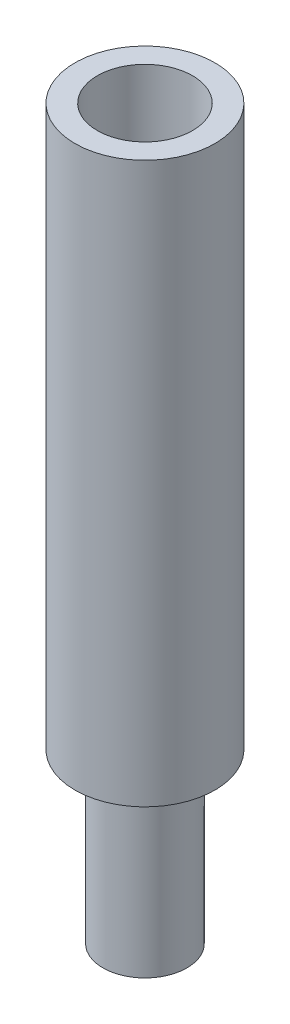
ISO-10303-21;
HEADER;
FILE_DESCRIPTION(('STEP AP214'),'2;1');
FILE_NAME('part.step','',(''),(''),'','','');
FILE_SCHEMA(('AUTOMOTIVE_DESIGN { 1 0 10303 214 1 1 1 1 }'));
ENDSEC;
DATA;
#1=APPLICATION_CONTEXT('core data for automotive mechanical design processes');
#2=APPLICATION_PROTOCOL_DEFINITION('international standard','automotive_design',2000,#1);
#3=PRODUCT_CONTEXT('',#1,'mechanical');
#4=PRODUCT('Part','Part','',(#3));
#5=PRODUCT_RELATED_PRODUCT_CATEGORY('part','',(#4));
#6=PRODUCT_DEFINITION_FORMATION('','',#4);
#7=PRODUCT_DEFINITION_CONTEXT('part definition',#1,'design');
#8=PRODUCT_DEFINITION('design','',#6,#7);
#9=PRODUCT_DEFINITION_SHAPE('','',#8);
#10=(LENGTH_UNIT() NAMED_UNIT(*) SI_UNIT(.MILLI.,.METRE.));
#11=(NAMED_UNIT(*) PLANE_ANGLE_UNIT() SI_UNIT($,.RADIAN.));
#12=(NAMED_UNIT(*) SI_UNIT($,.STERADIAN.) SOLID_ANGLE_UNIT());
#13=UNCERTAINTY_MEASURE_WITH_UNIT(LENGTH_MEASURE(1.E-05),#10,'distance_accuracy_value','');
#14=(GEOMETRIC_REPRESENTATION_CONTEXT(3) GLOBAL_UNCERTAINTY_ASSIGNED_CONTEXT((#13)) GLOBAL_UNIT_ASSIGNED_CONTEXT((#10,
#11,#12)) REPRESENTATION_CONTEXT('',''));
#15=CARTESIAN_POINT('',(0.,0.,0.));
#16=DIRECTION('',(0.,0.,1.));
#17=DIRECTION('',(1.,0.,0.));
#18=AXIS2_PLACEMENT_3D('',#15,#16,#17);
#19=CARTESIAN_POINT('',(0.,20.,0.));
#20=DIRECTION('',(0.,-1.,0.));
#21=DIRECTION('',(0.,0.,-1.));
#22=AXIS2_PLACEMENT_3D('',#19,#20,#21);
#23=CYLINDRICAL_SURFACE('',#22,2.5);
#24=CARTESIAN_POINT('',(0.,20.,0.));
#25=DIRECTION('',(0.,1.,0.));
#26=DIRECTION('',(0.,0.,1.));
#27=AXIS2_PLACEMENT_3D('',#24,#25,#26);
#28=CIRCLE('',#27,2.5);
#29=CARTESIAN_POINT('',(0.,20.,2.5));
#30=VERTEX_POINT('',#29);
#31=EDGE_CURVE('E49',#30,#30,#28,.T.);
#32=ORIENTED_EDGE('',*,*,#31,.F.);
#33=EDGE_LOOP('',(#32));
#34=FACE_BOUND('',#33,.T.);
#35=CARTESIAN_POINT('',(0.,0.,0.));
#36=DIRECTION('',(0.,1.,0.));
#37=DIRECTION('',(0.,0.,1.));
#38=AXIS2_PLACEMENT_3D('',#35,#36,#37);
#39=CIRCLE('',#38,2.5);
#40=CARTESIAN_POINT('',(0.,0.,2.5));
#41=VERTEX_POINT('',#40);
#42=EDGE_CURVE('E44',#41,#41,#39,.T.);
#43=ORIENTED_EDGE('',*,*,#42,.T.);
#44=EDGE_LOOP('',(#43));
#45=FACE_BOUND('',#44,.T.);
#46=ADVANCED_FACE('F41',(#34,#45),#23,.T.);
#47=CARTESIAN_POINT('',(0.,20.,0.));
#48=DIRECTION('',(0.,1.,0.));
#49=DIRECTION('',(0.,0.,1.));
#50=AXIS2_PLACEMENT_3D('',#47,#48,#49);
#51=PLANE('',#50);
#52=CARTESIAN_POINT('',(0.,20.,0.));
#53=DIRECTION('',(0.,1.,0.));
#54=DIRECTION('',(0.,0.,1.));
#55=AXIS2_PLACEMENT_3D('',#52,#53,#54);
#56=CIRCLE('',#55,1.7);
#57=CARTESIAN_POINT('',(0.,20.,1.7));
#58=VERTEX_POINT('',#57);
#59=EDGE_CURVE('E61',#58,#58,#56,.T.);
#60=ORIENTED_EDGE('',*,*,#59,.F.);
#61=EDGE_LOOP('',(#60));
#62=FACE_BOUND('',#61,.T.);
#63=ORIENTED_EDGE('',*,*,#31,.T.);
#64=EDGE_LOOP('',(#63));
#65=FACE_BOUND('',#64,.T.);
#66=ADVANCED_FACE('F78',(#62,#65),#51,.T.);
#67=CARTESIAN_POINT('',(0.,0.,0.));
#68=DIRECTION('',(0.,1.,0.));
#69=DIRECTION('',(0.,0.,1.));
#70=AXIS2_PLACEMENT_3D('',#67,#68,#69);
#71=PLANE('',#70);
#72=CARTESIAN_POINT('',(0.,0.,0.));
#73=DIRECTION('',(0.,-1.,0.));
#74=DIRECTION('',(0.,0.,-1.));
#75=AXIS2_PLACEMENT_3D('',#72,#73,#74);
#76=CIRCLE('',#75,1.5);
#77=CARTESIAN_POINT('',(0.,0.,-1.5));
#78=VERTEX_POINT('',#77);
#79=EDGE_CURVE('E10',#78,#78,#76,.T.);
#80=ORIENTED_EDGE('',*,*,#79,.F.);
#81=EDGE_LOOP('',(#80));
#82=FACE_BOUND('',#81,.T.);
#83=ORIENTED_EDGE('',*,*,#42,.F.);
#84=EDGE_LOOP('',(#83));
#85=FACE_BOUND('',#84,.T.);
#86=ADVANCED_FACE('F81',(#82,#85),#71,.F.);
#87=CARTESIAN_POINT('',(0.,-6.,0.));
#88=DIRECTION('',(0.,1.,0.));
#89=DIRECTION('',(0.,0.,1.));
#90=AXIS2_PLACEMENT_3D('',#87,#88,#89);
#91=CYLINDRICAL_SURFACE('',#90,1.5);
#92=CARTESIAN_POINT('',(0.,-6.,0.));
#93=DIRECTION('',(0.,-1.,0.));
#94=DIRECTION('',(0.,0.,-1.));
#95=AXIS2_PLACEMENT_3D('',#92,#93,#94);
#96=CIRCLE('',#95,1.5);
#97=CARTESIAN_POINT('',(0.,-6.,-1.5));
#98=VERTEX_POINT('',#97);
#99=EDGE_CURVE('E56',#98,#98,#96,.T.);
#100=ORIENTED_EDGE('',*,*,#99,.F.);
#101=EDGE_LOOP('',(#100));
#102=FACE_BOUND('',#101,.T.);
#103=ORIENTED_EDGE('',*,*,#79,.T.);
#104=EDGE_LOOP('',(#103));
#105=FACE_BOUND('',#104,.T.);
#106=ADVANCED_FACE('F92',(#102,#105),#91,.T.);
#107=CARTESIAN_POINT('',(0.,-6.,0.));
#108=DIRECTION('',(0.,-1.,0.));
#109=DIRECTION('',(0.,0.,-1.));
#110=AXIS2_PLACEMENT_3D('',#107,#108,#109);
#111=PLANE('',#110);
#112=ORIENTED_EDGE('',*,*,#99,.T.);
#113=EDGE_LOOP('',(#112));
#114=FACE_BOUND('',#113,.T.);
#115=ADVANCED_FACE('F74',(#114),#111,.T.);
#116=CARTESIAN_POINT('',(0.,10.,0.));
#117=DIRECTION('',(0.,1.,0.));
#118=DIRECTION('',(0.,0.,1.));
#119=AXIS2_PLACEMENT_3D('',#116,#117,#118);
#120=CYLINDRICAL_SURFACE('',#119,1.7);
#121=CARTESIAN_POINT('',(0.,10.,0.));
#122=DIRECTION('',(0.,1.,0.));
#123=DIRECTION('',(0.,0.,1.));
#124=AXIS2_PLACEMENT_3D('',#121,#122,#123);
#125=CIRCLE('',#124,1.7);
#126=CARTESIAN_POINT('',(0.,10.,1.7));
#127=VERTEX_POINT('',#126);
#128=EDGE_CURVE('E60',#127,#127,#125,.T.);
#129=ORIENTED_EDGE('',*,*,#128,.F.);
#130=EDGE_LOOP('',(#129));
#131=FACE_BOUND('',#130,.T.);
#132=ORIENTED_EDGE('',*,*,#59,.T.);
#133=EDGE_LOOP('',(#132));
#134=FACE_BOUND('',#133,.T.);
#135=ADVANCED_FACE('F71',(#131,#134),#120,.F.);
#136=CARTESIAN_POINT('',(0.,10.,0.));
#137=DIRECTION('',(0.,1.,0.));
#138=DIRECTION('',(0.,0.,1.));
#139=AXIS2_PLACEMENT_3D('',#136,#137,#138);
#140=PLANE('',#139);
#141=ORIENTED_EDGE('',*,*,#128,.T.);
#142=EDGE_LOOP('',(#141));
#143=FACE_BOUND('',#142,.T.);
#144=ADVANCED_FACE('F69',(#143),#140,.T.);
#145=CLOSED_SHELL('',(#46,#66,#86,#106,#115,#135,#144));
#146=MANIFOLD_SOLID_BREP('B2',#145);
#147=ADVANCED_BREP_SHAPE_REPRESENTATION('',(#18,#146),#14);
#148=SHAPE_DEFINITION_REPRESENTATION(#9,#147);
ENDSEC;
END-ISO-10303-21;
